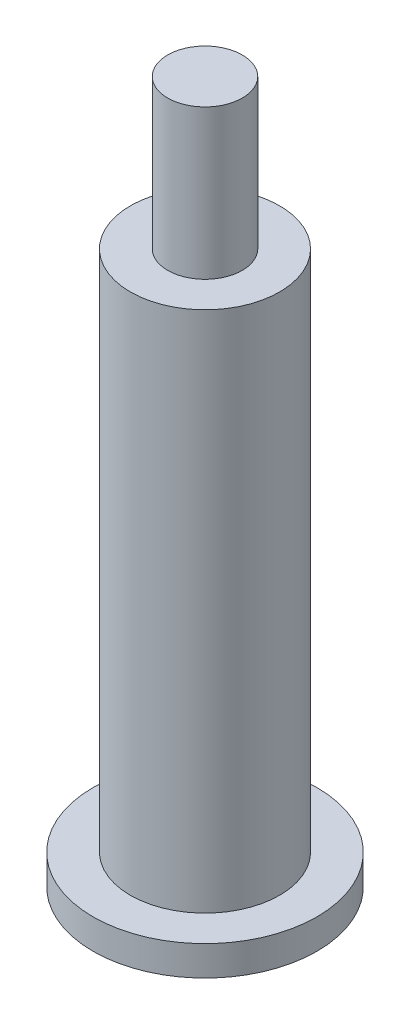
ISO-10303-21;
HEADER;
FILE_DESCRIPTION(('STEP AP214'),'2;1');
FILE_NAME('part.step','',(''),(''),'','','');
FILE_SCHEMA(('AUTOMOTIVE_DESIGN { 1 0 10303 214 1 1 1 1 }'));
ENDSEC;
DATA;
#1=APPLICATION_CONTEXT('core data for automotive mechanical design processes');
#2=APPLICATION_PROTOCOL_DEFINITION('international standard','automotive_design',2000,#1);
#3=PRODUCT_CONTEXT('',#1,'mechanical');
#4=PRODUCT('Part','Part','',(#3));
#5=PRODUCT_RELATED_PRODUCT_CATEGORY('part','',(#4));
#6=PRODUCT_DEFINITION_FORMATION('','',#4);
#7=PRODUCT_DEFINITION_CONTEXT('part definition',#1,'design');
#8=PRODUCT_DEFINITION('design','',#6,#7);
#9=PRODUCT_DEFINITION_SHAPE('','',#8);
#10=(LENGTH_UNIT() NAMED_UNIT(*) SI_UNIT(.MILLI.,.METRE.));
#11=(NAMED_UNIT(*) PLANE_ANGLE_UNIT() SI_UNIT($,.RADIAN.));
#12=(NAMED_UNIT(*) SI_UNIT($,.STERADIAN.) SOLID_ANGLE_UNIT());
#13=UNCERTAINTY_MEASURE_WITH_UNIT(LENGTH_MEASURE(1.E-05),#10,'distance_accuracy_value','');
#14=(GEOMETRIC_REPRESENTATION_CONTEXT(3) GLOBAL_UNCERTAINTY_ASSIGNED_CONTEXT((#13)) GLOBAL_UNIT_ASSIGNED_CONTEXT((#10,
#11,#12)) REPRESENTATION_CONTEXT('',''));
#15=CARTESIAN_POINT('',(0.,0.,0.));
#16=DIRECTION('',(0.,0.,1.));
#17=DIRECTION('',(1.,0.,0.));
#18=AXIS2_PLACEMENT_3D('',#15,#16,#17);
#19=CARTESIAN_POINT('',(0.,2.54,0.));
#20=DIRECTION('',(0.,-1.,0.));
#21=DIRECTION('',(0.,0.,-1.));
#22=AXIS2_PLACEMENT_3D('',#19,#20,#21);
#23=CYLINDRICAL_SURFACE('',#22,9.525);
#24=CARTESIAN_POINT('',(0.,2.54,0.));
#25=DIRECTION('',(0.,1.,0.));
#26=DIRECTION('',(0.,0.,1.));
#27=AXIS2_PLACEMENT_3D('',#24,#25,#26);
#28=CIRCLE('',#27,9.525);
#29=CARTESIAN_POINT('',(0.,2.54,9.525));
#30=VERTEX_POINT('',#29);
#31=EDGE_CURVE('E43',#30,#30,#28,.T.);
#32=ORIENTED_EDGE('',*,*,#31,.F.);
#33=EDGE_LOOP('',(#32));
#34=FACE_BOUND('',#33,.T.);
#35=CARTESIAN_POINT('',(0.,0.,0.));
#36=DIRECTION('',(0.,1.,0.));
#37=DIRECTION('',(0.,0.,1.));
#38=AXIS2_PLACEMENT_3D('',#35,#36,#37);
#39=CIRCLE('',#38,9.525);
#40=CARTESIAN_POINT('',(0.,0.,9.525));
#41=VERTEX_POINT('',#40);
#42=EDGE_CURVE('E34',#41,#41,#39,.T.);
#43=ORIENTED_EDGE('',*,*,#42,.T.);
#44=EDGE_LOOP('',(#43));
#45=FACE_BOUND('',#44,.T.);
#46=ADVANCED_FACE('F31',(#34,#45),#23,.T.);
#47=CARTESIAN_POINT('',(0.,2.54,0.));
#48=DIRECTION('',(0.,1.,0.));
#49=DIRECTION('',(0.,0.,1.));
#50=AXIS2_PLACEMENT_3D('',#47,#48,#49);
#51=PLANE('',#50);
#52=CARTESIAN_POINT('',(0.,2.54,0.));
#53=DIRECTION('',(0.,1.,0.));
#54=DIRECTION('',(0.,0.,1.));
#55=AXIS2_PLACEMENT_3D('',#52,#53,#54);
#56=CIRCLE('',#55,6.35);
#57=CARTESIAN_POINT('',(0.,2.54,6.35));
#58=VERTEX_POINT('',#57);
#59=EDGE_CURVE('E38',#58,#58,#56,.T.);
#60=ORIENTED_EDGE('',*,*,#59,.F.);
#61=EDGE_LOOP('',(#60));
#62=FACE_BOUND('',#61,.T.);
#63=ORIENTED_EDGE('',*,*,#31,.T.);
#64=EDGE_LOOP('',(#63));
#65=FACE_BOUND('',#64,.T.);
#66=ADVANCED_FACE('F60',(#62,#65),#51,.T.);
#67=CARTESIAN_POINT('',(0.,0.,0.));
#68=DIRECTION('',(0.,1.,0.));
#69=DIRECTION('',(0.,0.,1.));
#70=AXIS2_PLACEMENT_3D('',#67,#68,#69);
#71=PLANE('',#70);
#72=ORIENTED_EDGE('',*,*,#42,.F.);
#73=EDGE_LOOP('',(#72));
#74=FACE_BOUND('',#73,.T.);
#75=ADVANCED_FACE('F57',(#74),#71,.F.);
#76=CARTESIAN_POINT('',(0.,46.99,0.));
#77=DIRECTION('',(0.,-1.,0.));
#78=DIRECTION('',(0.,0.,-1.));
#79=AXIS2_PLACEMENT_3D('',#76,#77,#78);
#80=CYLINDRICAL_SURFACE('',#79,6.35);
#81=CARTESIAN_POINT('',(0.,46.99,0.));
#82=DIRECTION('',(0.,1.,0.));
#83=DIRECTION('',(0.,0.,1.));
#84=AXIS2_PLACEMENT_3D('',#81,#82,#83);
#85=CIRCLE('',#84,6.35);
#86=CARTESIAN_POINT('',(0.,46.99,6.35));
#87=VERTEX_POINT('',#86);
#88=EDGE_CURVE('E48',#87,#87,#85,.T.);
#89=ORIENTED_EDGE('',*,*,#88,.F.);
#90=EDGE_LOOP('',(#89));
#91=FACE_BOUND('',#90,.T.);
#92=ORIENTED_EDGE('',*,*,#59,.T.);
#93=EDGE_LOOP('',(#92));
#94=FACE_BOUND('',#93,.T.);
#95=ADVANCED_FACE('F59',(#91,#94),#80,.T.);
#96=CARTESIAN_POINT('',(0.,46.99,0.));
#97=DIRECTION('',(0.,1.,0.));
#98=DIRECTION('',(0.,0.,1.));
#99=AXIS2_PLACEMENT_3D('',#96,#97,#98);
#100=PLANE('',#99);
#101=CARTESIAN_POINT('',(0.,46.99,0.));
#102=DIRECTION('',(0.,1.,0.));
#103=DIRECTION('',(0.,0.,1.));
#104=AXIS2_PLACEMENT_3D('',#101,#102,#103);
#105=CIRCLE('',#104,3.175);
#106=CARTESIAN_POINT('',(0.,46.99,3.175));
#107=VERTEX_POINT('',#106);
#108=EDGE_CURVE('E10',#107,#107,#105,.T.);
#109=ORIENTED_EDGE('',*,*,#108,.F.);
#110=EDGE_LOOP('',(#109));
#111=FACE_BOUND('',#110,.T.);
#112=ORIENTED_EDGE('',*,*,#88,.T.);
#113=EDGE_LOOP('',(#112));
#114=FACE_BOUND('',#113,.T.);
#115=ADVANCED_FACE('F65',(#111,#114),#100,.T.);
#116=CARTESIAN_POINT('',(0.,59.69,0.));
#117=DIRECTION('',(0.,-1.,0.));
#118=DIRECTION('',(0.,0.,-1.));
#119=AXIS2_PLACEMENT_3D('',#116,#117,#118);
#120=CYLINDRICAL_SURFACE('',#119,3.175);
#121=CARTESIAN_POINT('',(0.,59.69,0.));
#122=DIRECTION('',(0.,1.,0.));
#123=DIRECTION('',(0.,0.,1.));
#124=AXIS2_PLACEMENT_3D('',#121,#122,#123);
#125=CIRCLE('',#124,3.175);
#126=CARTESIAN_POINT('',(0.,59.69,3.175));
#127=VERTEX_POINT('',#126);
#128=EDGE_CURVE('E47',#127,#127,#125,.T.);
#129=ORIENTED_EDGE('',*,*,#128,.F.);
#130=EDGE_LOOP('',(#129));
#131=FACE_BOUND('',#130,.T.);
#132=ORIENTED_EDGE('',*,*,#108,.T.);
#133=EDGE_LOOP('',(#132));
#134=FACE_BOUND('',#133,.T.);
#135=ADVANCED_FACE('F95',(#131,#134),#120,.T.);
#136=CARTESIAN_POINT('',(0.,59.69,0.));
#137=DIRECTION('',(0.,1.,0.));
#138=DIRECTION('',(0.,0.,1.));
#139=AXIS2_PLACEMENT_3D('',#136,#137,#138);
#140=PLANE('',#139);
#141=ORIENTED_EDGE('',*,*,#128,.T.);
#142=EDGE_LOOP('',(#141));
#143=FACE_BOUND('',#142,.T.);
#144=ADVANCED_FACE('F105',(#143),#140,.T.);
#145=CLOSED_SHELL('',(#46,#66,#75,#95,#115,#135,#144));
#146=MANIFOLD_SOLID_BREP('B2',#145);
#147=ADVANCED_BREP_SHAPE_REPRESENTATION('',(#18,#146),#14);
#148=SHAPE_DEFINITION_REPRESENTATION(#9,#147);
ENDSEC;
END-ISO-10303-21;
